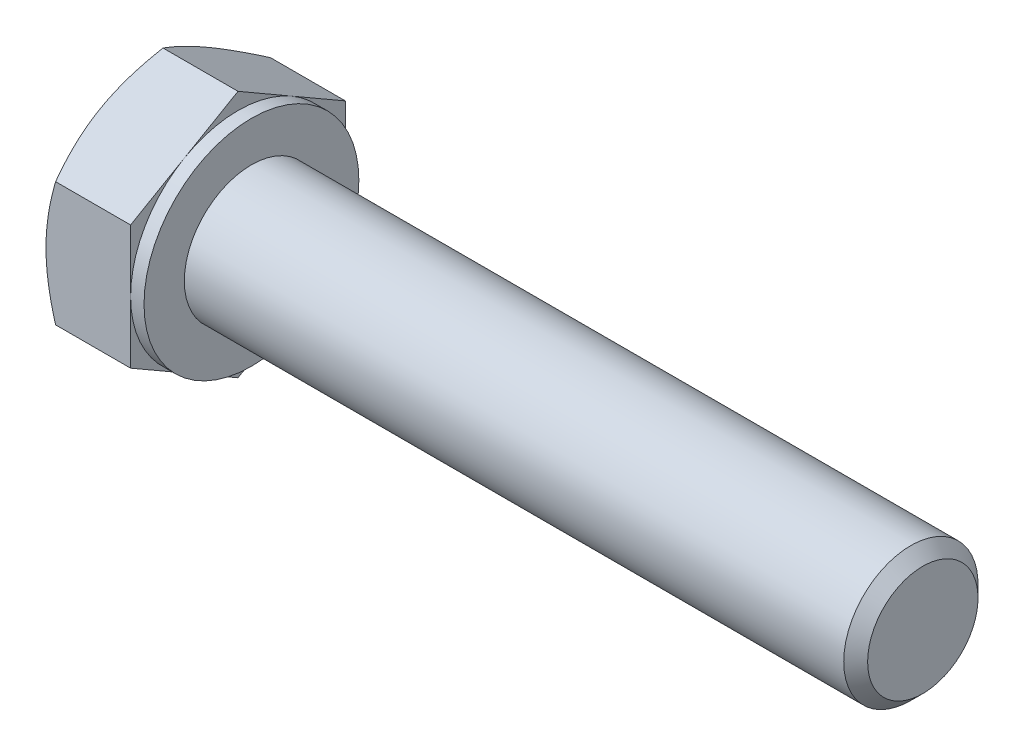
ISO-10303-21;
HEADER;
FILE_DESCRIPTION(('STEP AP214'),'2;1');
FILE_NAME('part.step','',(''),(''),'','','');
FILE_SCHEMA(('AUTOMOTIVE_DESIGN { 1 0 10303 214 1 1 1 1 }'));
ENDSEC;
DATA;
#1=APPLICATION_CONTEXT('core data for automotive mechanical design processes');
#2=APPLICATION_PROTOCOL_DEFINITION('international standard','automotive_design',2000,#1);
#3=PRODUCT_CONTEXT('',#1,'mechanical');
#4=PRODUCT('Part','Part','',(#3));
#5=PRODUCT_RELATED_PRODUCT_CATEGORY('part','',(#4));
#6=PRODUCT_DEFINITION_FORMATION('','',#4);
#7=PRODUCT_DEFINITION_CONTEXT('part definition',#1,'design');
#8=PRODUCT_DEFINITION('design','',#6,#7);
#9=PRODUCT_DEFINITION_SHAPE('','',#8);
#10=(LENGTH_UNIT() NAMED_UNIT(*) SI_UNIT(.MILLI.,.METRE.));
#11=(NAMED_UNIT(*) PLANE_ANGLE_UNIT() SI_UNIT($,.RADIAN.));
#12=(NAMED_UNIT(*) SI_UNIT($,.STERADIAN.) SOLID_ANGLE_UNIT());
#13=UNCERTAINTY_MEASURE_WITH_UNIT(LENGTH_MEASURE(1.E-05),#10,'distance_accuracy_value','');
#14=(GEOMETRIC_REPRESENTATION_CONTEXT(3) GLOBAL_UNCERTAINTY_ASSIGNED_CONTEXT((#13)) GLOBAL_UNIT_ASSIGNED_CONTEXT((#10,
#11,#12)) REPRESENTATION_CONTEXT('',''));
#15=CARTESIAN_POINT('',(0.,0.,0.));
#16=DIRECTION('',(0.,0.,1.));
#17=DIRECTION('',(1.,0.,0.));
#18=AXIS2_PLACEMENT_3D('',#15,#16,#17);
#19=CARTESIAN_POINT('',(3.65,4.61880215351701,0.));
#20=DIRECTION('',(1.,0.,0.));
#21=DIRECTION('',(0.,0.,-1.));
#22=AXIS2_PLACEMENT_3D('',#19,#20,#21);
#23=PLANE('',#22);
#24=CARTESIAN_POINT('',(3.65,0.,0.));
#25=DIRECTION('',(1.,0.,0.));
#26=DIRECTION('',(0.,0.,-1.));
#27=AXIS2_PLACEMENT_3D('',#24,#25,#26);
#28=CIRCLE('',#27,2.5);
#29=CARTESIAN_POINT('',(3.65,0.,-2.5));
#30=VERTEX_POINT('',#29);
#31=EDGE_CURVE('E274',#30,#30,#28,.F.);
#32=ORIENTED_EDGE('',*,*,#31,.T.);
#33=EDGE_LOOP('',(#32));
#34=FACE_BOUND('',#33,.T.);
#35=CARTESIAN_POINT('',(3.65,0.,0.));
#36=DIRECTION('',(1.,0.,0.));
#37=DIRECTION('',(0.,0.,-1.));
#38=AXIS2_PLACEMENT_3D('',#35,#36,#37);
#39=CIRCLE('',#38,4.);
#40=CARTESIAN_POINT('',(3.65,0.,-4.));
#41=VERTEX_POINT('',#40);
#42=EDGE_CURVE('E293',#41,#41,#39,.T.);
#43=ORIENTED_EDGE('',*,*,#42,.T.);
#44=EDGE_LOOP('',(#43));
#45=FACE_BOUND('',#44,.T.);
#46=ADVANCED_FACE('F36',(#34,#45),#23,.T.);
#47=CARTESIAN_POINT('',(0.,0.,0.));
#48=DIRECTION('',(-1.,0.,0.));
#49=DIRECTION('',(0.,0.,1.));
#50=AXIS2_PLACEMENT_3D('',#47,#48,#49);
#51=CYLINDRICAL_SURFACE('',#50,2.5);
#52=ORIENTED_EDGE('',*,*,#31,.F.);
#53=EDGE_LOOP('',(#52));
#54=FACE_BOUND('',#53,.T.);
#55=CARTESIAN_POINT('',(28.205,0.,0.));
#56=DIRECTION('',(-1.,0.,0.));
#57=DIRECTION('',(0.,0.,1.));
#58=AXIS2_PLACEMENT_3D('',#55,#56,#57);
#59=CIRCLE('',#58,2.5);
#60=CARTESIAN_POINT('',(28.205,0.,2.5));
#61=VERTEX_POINT('',#60);
#62=EDGE_CURVE('E271',#61,#61,#59,.T.);
#63=ORIENTED_EDGE('',*,*,#62,.T.);
#64=EDGE_LOOP('',(#63));
#65=FACE_BOUND('',#64,.T.);
#66=ADVANCED_FACE('F245',(#54,#65),#51,.T.);
#67=CARTESIAN_POINT('',(28.65,0.,0.));
#68=DIRECTION('',(-1.,0.,0.));
#69=DIRECTION('',(0.,0.,1.));
#70=AXIS2_PLACEMENT_3D('',#67,#68,#69);
#71=CONICAL_SURFACE('',#70,2.055,0.78539816339744);
#72=ORIENTED_EDGE('',*,*,#62,.F.);
#73=EDGE_LOOP('',(#72));
#74=FACE_BOUND('',#73,.T.);
#75=CARTESIAN_POINT('',(28.65,0.,0.));
#76=DIRECTION('',(-1.,0.,0.));
#77=DIRECTION('',(0.,0.,1.));
#78=AXIS2_PLACEMENT_3D('',#75,#76,#77);
#79=CIRCLE('',#78,2.055);
#80=CARTESIAN_POINT('',(28.65,0.,2.055));
#81=VERTEX_POINT('',#80);
#82=EDGE_CURVE('E269',#81,#81,#79,.T.);
#83=ORIENTED_EDGE('',*,*,#82,.T.);
#84=EDGE_LOOP('',(#83));
#85=FACE_BOUND('',#84,.T.);
#86=ADVANCED_FACE('F250',(#74,#85),#71,.T.);
#87=CARTESIAN_POINT('',(28.65,0.,0.));
#88=DIRECTION('',(-1.,0.,0.));
#89=DIRECTION('',(0.,0.,1.));
#90=AXIS2_PLACEMENT_3D('',#87,#88,#89);
#91=PLANE('',#90);
#92=ORIENTED_EDGE('',*,*,#82,.F.);
#93=EDGE_LOOP('',(#92));
#94=FACE_BOUND('',#93,.T.);
#95=ADVANCED_FACE('F257',(#94),#91,.F.);
#96=CARTESIAN_POINT('',(3.15,4.,0.));
#97=DIRECTION('',(1.,0.,0.));
#98=DIRECTION('',(0.,0.,-1.));
#99=AXIS2_PLACEMENT_3D('',#96,#97,#98);
#100=PLANE('',#99);
#101=DIRECTION('',(0.,0.500000000000001,0.866025403784438));
#102=VECTOR('',#101,1.);
#103=CARTESIAN_POINT('',(3.15,2.3094010767585,-4.));
#104=LINE('',#103,#102);
#105=CARTESIAN_POINT('',(3.15,2.3094010767585,-4.));
#106=VERTEX_POINT('',#105);
#107=CARTESIAN_POINT('',(3.15,3.46410161513775,-2.00000000000001));
#108=VERTEX_POINT('',#107);
#109=EDGE_CURVE('E169',#106,#108,#104,.T.);
#110=ORIENTED_EDGE('',*,*,#109,.T.);
#111=CARTESIAN_POINT('',(3.15,0.,0.));
#112=DIRECTION('',(-1.,0.,0.));
#113=DIRECTION('',(0.,0.,1.));
#114=AXIS2_PLACEMENT_3D('',#111,#112,#113);
#115=CIRCLE('',#114,4.);
#116=CARTESIAN_POINT('',(3.15,0.,-4.));
#117=VERTEX_POINT('',#116);
#118=EDGE_CURVE('E52',#108,#117,#115,.T.);
#119=ORIENTED_EDGE('',*,*,#118,.T.);
#120=DIRECTION('',(0.,1.,0.));
#121=VECTOR('',#120,1.);
#122=CARTESIAN_POINT('',(3.15,2.3094010767585,-4.));
#123=LINE('',#122,#121);
#124=EDGE_CURVE('E41',#117,#106,#123,.T.);
#125=ORIENTED_EDGE('',*,*,#124,.T.);
#126=EDGE_LOOP('',(#110,#119,#125));
#127=FACE_BOUND('',#126,.T.);
#128=ADVANCED_FACE('F260',(#127),#100,.T.);
#129=CARTESIAN_POINT('',(3.15,4.61880215351701,0.));
#130=VERTEX_POINT('',#129);
#131=EDGE_CURVE('E167',#108,#130,#104,.T.);
#132=ORIENTED_EDGE('',*,*,#131,.T.);
#133=DIRECTION('',(0.,-0.500000000000001,0.866025403784438));
#134=VECTOR('',#133,1.);
#135=CARTESIAN_POINT('',(3.15,4.61880215351701,0.));
#136=LINE('',#135,#134);
#137=CARTESIAN_POINT('',(3.15,3.46410161513775,2.));
#138=VERTEX_POINT('',#137);
#139=EDGE_CURVE('E166',#130,#138,#136,.T.);
#140=ORIENTED_EDGE('',*,*,#139,.T.);
#141=EDGE_CURVE('E155',#138,#108,#115,.T.);
#142=ORIENTED_EDGE('',*,*,#141,.T.);
#143=EDGE_LOOP('',(#132,#140,#142));
#144=FACE_BOUND('',#143,.T.);
#145=ADVANCED_FACE('F265',(#144),#100,.T.);
#146=CARTESIAN_POINT('',(3.15,2.30940107675851,3.99999999999999));
#147=VERTEX_POINT('',#146);
#148=EDGE_CURVE('E134',#138,#147,#136,.T.);
#149=ORIENTED_EDGE('',*,*,#148,.T.);
#150=DIRECTION('',(0.,-1.,0.));
#151=VECTOR('',#150,1.);
#152=CARTESIAN_POINT('',(3.15,2.30940107675851,3.99999999999999));
#153=LINE('',#152,#151);
#154=CARTESIAN_POINT('',(3.15,0.,4.));
#155=VERTEX_POINT('',#154);
#156=EDGE_CURVE('E128',#147,#155,#153,.T.);
#157=ORIENTED_EDGE('',*,*,#156,.T.);
#158=EDGE_CURVE('E132',#155,#138,#115,.T.);
#159=ORIENTED_EDGE('',*,*,#158,.T.);
#160=EDGE_LOOP('',(#149,#157,#159));
#161=FACE_BOUND('',#160,.T.);
#162=ADVANCED_FACE('F130',(#161),#100,.T.);
#163=CARTESIAN_POINT('',(3.15,-2.30940107675849,4.));
#164=VERTEX_POINT('',#163);
#165=EDGE_CURVE('E138',#155,#164,#153,.T.);
#166=ORIENTED_EDGE('',*,*,#165,.T.);
#167=DIRECTION('',(0.,-0.500000000000002,-0.866025403784438));
#168=VECTOR('',#167,1.);
#169=CARTESIAN_POINT('',(3.15,-4.618802153517,0.));
#170=LINE('',#169,#168);
#171=CARTESIAN_POINT('',(3.15,-3.46410161513775,2.00000000000001));
#172=VERTEX_POINT('',#171);
#173=EDGE_CURVE('E145',#164,#172,#170,.T.);
#174=ORIENTED_EDGE('',*,*,#173,.T.);
#175=EDGE_CURVE('E142',#172,#155,#115,.T.);
#176=ORIENTED_EDGE('',*,*,#175,.T.);
#177=EDGE_LOOP('',(#166,#174,#176));
#178=FACE_BOUND('',#177,.T.);
#179=ADVANCED_FACE('F143',(#178),#100,.T.);
#180=CARTESIAN_POINT('',(3.15,-4.618802153517,0.));
#181=VERTEX_POINT('',#180);
#182=EDGE_CURVE('E161',#172,#181,#170,.T.);
#183=ORIENTED_EDGE('',*,*,#182,.T.);
#184=DIRECTION('',(0.,0.499999999999999,-0.866025403784439));
#185=VECTOR('',#184,1.);
#186=CARTESIAN_POINT('',(3.15,-2.3094010767585,-4.));
#187=LINE('',#186,#185);
#188=CARTESIAN_POINT('',(3.15,-3.46410161513776,-2.));
#189=VERTEX_POINT('',#188);
#190=EDGE_CURVE('E329',#181,#189,#187,.T.);
#191=ORIENTED_EDGE('',*,*,#190,.T.);
#192=EDGE_CURVE('E149',#189,#172,#115,.T.);
#193=ORIENTED_EDGE('',*,*,#192,.T.);
#194=EDGE_LOOP('',(#183,#191,#193));
#195=FACE_BOUND('',#194,.T.);
#196=ADVANCED_FACE('F334',(#195),#100,.T.);
#197=CARTESIAN_POINT('',(3.15,-2.3094010767585,-4.));
#198=VERTEX_POINT('',#197);
#199=EDGE_CURVE('E156',#189,#198,#187,.T.);
#200=ORIENTED_EDGE('',*,*,#199,.T.);
#201=EDGE_CURVE('E11',#198,#117,#123,.T.);
#202=ORIENTED_EDGE('',*,*,#201,.T.);
#203=EDGE_CURVE('E347',#117,#189,#115,.T.);
#204=ORIENTED_EDGE('',*,*,#203,.T.);
#205=EDGE_LOOP('',(#200,#202,#204));
#206=FACE_BOUND('',#205,.T.);
#207=ADVANCED_FACE('F266',(#206),#100,.T.);
#208=CARTESIAN_POINT('',(0.,0.,0.));
#209=DIRECTION('',(-1.,0.,0.));
#210=DIRECTION('',(0.,0.,1.));
#211=AXIS2_PLACEMENT_3D('',#208,#209,#210);
#212=CYLINDRICAL_SURFACE('',#211,4.);
#213=ORIENTED_EDGE('',*,*,#118,.F.);
#214=ORIENTED_EDGE('',*,*,#141,.F.);
#215=ORIENTED_EDGE('',*,*,#158,.F.);
#216=ORIENTED_EDGE('',*,*,#175,.F.);
#217=ORIENTED_EDGE('',*,*,#192,.F.);
#218=ORIENTED_EDGE('',*,*,#203,.F.);
#219=EDGE_LOOP('',(#213,#214,#215,#216,#217,#218));
#220=FACE_BOUND('',#219,.T.);
#221=ORIENTED_EDGE('',*,*,#42,.F.);
#222=EDGE_LOOP('',(#221));
#223=FACE_BOUND('',#222,.T.);
#224=ADVANCED_FACE('F152',(#220,#223),#212,.T.);
#225=CARTESIAN_POINT('',(0.,4.61880215351701,0.));
#226=DIRECTION('',(1.,0.,0.));
#227=DIRECTION('',(0.,0.,-1.));
#228=AXIS2_PLACEMENT_3D('',#225,#226,#227);
#229=PLANE('',#228);
#230=CARTESIAN_POINT('',(0.,0.,0.));
#231=DIRECTION('',(1.,0.,0.));
#232=DIRECTION('',(0.,0.,-1.));
#233=AXIS2_PLACEMENT_3D('',#230,#231,#232);
#234=CIRCLE('',#233,4.);
#235=CARTESIAN_POINT('',(0.,0.,-4.));
#236=VERTEX_POINT('',#235);
#237=CARTESIAN_POINT('',(0.,3.46410161513775,-2.00000000000001));
#238=VERTEX_POINT('',#237);
#239=EDGE_CURVE('E292',#236,#238,#234,.T.);
#240=ORIENTED_EDGE('',*,*,#239,.F.);
#241=CARTESIAN_POINT('',(0.,-3.46410161513776,-2.));
#242=VERTEX_POINT('',#241);
#243=EDGE_CURVE('E289',#242,#236,#234,.T.);
#244=ORIENTED_EDGE('',*,*,#243,.F.);
#245=CARTESIAN_POINT('',(0.,-3.46410161513775,2.00000000000001));
#246=VERTEX_POINT('',#245);
#247=EDGE_CURVE('E291',#246,#242,#234,.T.);
#248=ORIENTED_EDGE('',*,*,#247,.F.);
#249=CARTESIAN_POINT('',(0.,0.,4.));
#250=VERTEX_POINT('',#249);
#251=EDGE_CURVE('E301',#250,#246,#234,.T.);
#252=ORIENTED_EDGE('',*,*,#251,.F.);
#253=CARTESIAN_POINT('',(0.,0.,0.));
#254=DIRECTION('',(-1.,0.,0.));
#255=DIRECTION('',(0.,0.,1.));
#256=AXIS2_PLACEMENT_3D('',#253,#254,#255);
#257=CIRCLE('',#256,4.);
#258=CARTESIAN_POINT('',(0.,3.46410161513775,2.));
#259=VERTEX_POINT('',#258);
#260=EDGE_CURVE('E170',#250,#259,#257,.T.);
#261=ORIENTED_EDGE('',*,*,#260,.T.);
#262=EDGE_CURVE('E296',#238,#259,#234,.T.);
#263=ORIENTED_EDGE('',*,*,#262,.F.);
#264=EDGE_LOOP('',(#240,#244,#248,#252,#261,#263));
#265=FACE_BOUND('',#264,.T.);
#266=ADVANCED_FACE('F199',(#265),#229,.F.);
#267=CARTESIAN_POINT('',(0.,0.,0.));
#268=DIRECTION('',(1.,0.,0.));
#269=DIRECTION('',(0.,0.,-1.));
#270=AXIS2_PLACEMENT_3D('',#267,#268,#269);
#271=CONICAL_SURFACE('',#270,4.,1.0471975511966);
#272=CARTESIAN_POINT('',(0.357332259074763,2.30928560670467,4.00019999999999));
#273=CARTESIAN_POINT('',(0.29871787364828,2.41077174646171,3.82442084967676));
#274=CARTESIAN_POINT('',(0.245410321462261,2.513133908835,3.64712438367361));
#275=CARTESIAN_POINT('',(0.152361670746402,2.71963072479812,3.28946140682429));
#276=CARTESIAN_POINT('',(0.112653489029703,2.82376904741905,3.10908854102984));
#277=CARTESIAN_POINT('',(0.0508422152802788,3.03075510011796,2.7505781812972));
#278=CARTESIAN_POINT('',(0.028327731522889,3.13357098372492,2.57249584706485));
#279=CARTESIAN_POINT('',(0.00145062314658275,3.33968651028529,2.21549328283349));
#280=CARTESIAN_POINT('',(-0.00293425857305552,3.44298540411435,2.03657435035589));
#281=CARTESIAN_POINT('',(0.00619007293997221,3.63600352522933,1.70225715780326));
#282=CARTESIAN_POINT('',(0.0174589539879965,3.72575165335065,1.54680884001293));
#283=CARTESIAN_POINT('',(0.0531739907981958,3.90466320392055,1.23692494436494));
#284=CARTESIAN_POINT('',(0.0776323457115357,3.99382600759479,1.08249043825587));
#285=CARTESIAN_POINT('',(0.138776064919292,4.17310641015198,0.77196767222542));
#286=CARTESIAN_POINT('',(0.175720603654866,4.26320131938132,0.615918711936896));
#287=CARTESIAN_POINT('',(0.25957007254803,4.44204742827551,0.30614816459616));
#288=CARTESIAN_POINT('',(0.306455302212743,4.53080091904967,0.152422609226221));
#289=CARTESIAN_POINT('',(0.35733225907477,4.61891762357085,-0.000200000000000127));
#290=B_SPLINE_CURVE_WITH_KNOTS('',3,(#272,#273,#274,#275,#276,#277,#278,#279,#280,#281,#282,
#283,#284,#285,#286,#287,#288,#289),.UNSPECIFIED.,.F.,.F.,(4,2,2,2,2,2,2,2,4),(0.,
0.634047835695966,1.26961969224543,1.88946157213122,2.50854226669297,3.04757825393385,
3.58711366126903,4.13861653143763,4.68903648037742),.UNSPECIFIED.);
#291=CARTESIAN_POINT('',(0.357265589908165,4.61880215351701,0.));
#292=VERTEX_POINT('',#291);
#293=EDGE_CURVE('E217',#259,#292,#290,.T.);
#294=ORIENTED_EDGE('',*,*,#293,.T.);
#295=CARTESIAN_POINT('',(0.357332259074769,4.61891762357085,0.0002));
#296=CARTESIAN_POINT('',(0.298717873648285,4.51743148381381,-0.175579150323228));
#297=CARTESIAN_POINT('',(0.245410321462265,4.41506932144052,-0.352875616326381));
#298=CARTESIAN_POINT('',(0.152361670746406,4.2085725054774,-0.710538593175706));
#299=CARTESIAN_POINT('',(0.112653489029706,4.10443418285647,-0.890911458970151));
#300=CARTESIAN_POINT('',(0.0508422152802806,3.89744813015756,-1.24942181870279));
#301=CARTESIAN_POINT('',(0.02832773152289,3.7946322465506,-1.42750415293514));
#302=CARTESIAN_POINT('',(0.00145062314658251,3.58851671999023,-1.78450671716651));
#303=CARTESIAN_POINT('',(-0.00293425857305628,3.48521782616117,-1.9634256496441));
#304=CARTESIAN_POINT('',(0.0061900729399703,3.29219970504619,-2.29774284219673));
#305=CARTESIAN_POINT('',(0.017458953987994,3.20245157692486,-2.45319115998707));
#306=CARTESIAN_POINT('',(0.0531739907981924,3.02354002635497,-2.76307505563506));
#307=CARTESIAN_POINT('',(0.0776323457115321,2.93437722268073,-2.91750956174413));
#308=CARTESIAN_POINT('',(0.138776064919288,2.75509682012354,-3.22803232777458));
#309=CARTESIAN_POINT('',(0.175720603654862,2.6650019108942,-3.3840812880631));
#310=CARTESIAN_POINT('',(0.259570072548025,2.486155802,-3.69385183540384));
#311=CARTESIAN_POINT('',(0.306455302212738,2.39740231122584,-3.84757739077378));
#312=CARTESIAN_POINT('',(0.357332259074764,2.30928560670466,-4.0002));
#313=B_SPLINE_CURVE_WITH_KNOTS('',3,(#295,#296,#297,#298,#299,#300,#301,#302,#303,#304,#305,
#306,#307,#308,#309,#310,#311,#312),.UNSPECIFIED.,.F.,.F.,(4,2,2,2,2,2,2,2,4),(0.,
0.634047835695967,1.26961969224543,1.88946157213122,2.50854226669297,3.04757825393386,
3.58711366126904,4.13861653143764,4.68903648037744),.UNSPECIFIED.);
#314=EDGE_CURVE('E60',#292,#238,#313,.T.);
#315=ORIENTED_EDGE('',*,*,#314,.T.);
#316=ORIENTED_EDGE('',*,*,#262,.T.);
#317=EDGE_LOOP('',(#294,#315,#316));
#318=FACE_BOUND('',#317,.T.);
#319=ADVANCED_FACE('F343',(#318),#271,.T.);
#320=CARTESIAN_POINT('',(2.00011120385046,-6.3020384234118,4.));
#321=CARTESIAN_POINT('',(1.91454696302706,-6.12645846502783,4.));
#322=CARTESIAN_POINT('',(1.82977515690346,-5.95048585438814,4.));
#323=CARTESIAN_POINT('',(1.66226027661303,-5.59754684141579,4.));
#324=CARTESIAN_POINT('',(1.57951750403357,-5.42058029609573,4.));
#325=CARTESIAN_POINT('',(1.4161092617051,-5.06457985037646,4.));
#326=CARTESIAN_POINT('',(1.33545672605323,-4.88553999327038,4.));
#327=CARTESIAN_POINT('',(1.17732357965482,-4.52607013031636,4.));
#328=CARTESIAN_POINT('',(1.09984282527701,-4.34564018785782,4.));
#329=CARTESIAN_POINT('',(0.946328317401932,-3.97695712218341,4.));
#330=CARTESIAN_POINT('',(0.870432703669638,-3.78864617451162,4.));
#331=CARTESIAN_POINT('',(0.724150215280466,-3.40985798807119,4.));
#332=CARTESIAN_POINT('',(0.653763944661544,-3.21938051438195,4.));
#333=CARTESIAN_POINT('',(0.520275623047364,-2.83628176991272,4.));
#334=CARTESIAN_POINT('',(0.45715965099107,-2.64366539743604,4.));
#335=CARTESIAN_POINT('',(0.340171517307153,-2.25567134243401,4.));
#336=CARTESIAN_POINT('',(0.286296547451801,-2.0602945183805,4.));
#337=CARTESIAN_POINT('',(0.190596079734453,-1.66775019550377,4.));
#338=CARTESIAN_POINT('',(0.148703055513719,-1.47059946088018,4.));
#339=CARTESIAN_POINT('',(0.0792701946386885,-1.07374632394225,4.));
#340=CARTESIAN_POINT('',(0.0517287926791943,-0.874044202338188,4.));
#341=CARTESIAN_POINT('',(0.0135517370726251,-0.475733693101269,4.));
#342=CARTESIAN_POINT('',(0.00269106574828716,-0.277147419592168,4.));
#343=CARTESIAN_POINT('',(-0.00180277188208452,0.120241435280113,4.));
#344=CARTESIAN_POINT('',(0.0045643092577363,0.319044019709217,4.));
#345=CARTESIAN_POINT('',(0.0293199840216128,0.653649130511211,4.));
#346=CARTESIAN_POINT('',(0.0433487693682711,0.789796203877411,3.99999999999999));
#347=CARTESIAN_POINT('',(0.0786650583146089,1.06115179654903,3.99999999999999));
#348=CARTESIAN_POINT('',(0.0999534649347826,1.19636019695748,3.99999999999999));
#349=CARTESIAN_POINT('',(0.173595112588807,1.60036108675972,3.99999999999999));
#350=CARTESIAN_POINT('',(0.235713609104601,1.86739657992387,3.99999999999999));
#351=CARTESIAN_POINT('',(0.344187906710576,2.26690842076046,3.99999999999999));
#352=CARTESIAN_POINT('',(0.383434483337922,2.40143348236976,3.99999999999999));
#353=CARTESIAN_POINT('',(0.466191101497679,2.66917849144139,3.99999999999999));
#354=CARTESIAN_POINT('',(0.509701176020063,2.8023984287962,3.99999999999999));
#355=CARTESIAN_POINT('',(0.600271093153284,3.06757339019426,3.99999999999999));
#356=CARTESIAN_POINT('',(0.647329942526203,3.19952875660039,3.99999999999999));
#357=CARTESIAN_POINT('',(0.744425095187851,3.46233233841868,3.99999999999999));
#358=CARTESIAN_POINT('',(0.794461329420509,3.59318057942866,3.99999999999999));
#359=CARTESIAN_POINT('',(0.933355738336686,3.94627302000952,3.99999999999999));
#360=CARTESIAN_POINT('',(1.02459875944488,4.16757823468635,3.99999999999999));
#361=CARTESIAN_POINT('',(1.21247228327858,4.60789849544448,3.99999999999999));
#362=CARTESIAN_POINT('',(1.30910339202328,4.82691328060903,3.99999999999999));
#363=CARTESIAN_POINT('',(1.50647026541792,5.26317250155478,3.99999999999999));
#364=CARTESIAN_POINT('',(1.60720746834517,5.48041628445573,3.99999999999999));
#365=CARTESIAN_POINT('',(1.81181128465854,5.9134283158317,3.99999999999999));
#366=CARTESIAN_POINT('',(1.91567799508362,6.12919651829726,3.99999999999999));
#367=CARTESIAN_POINT('',(2.1260176887459,6.55988021726239,3.99999999999999));
#368=CARTESIAN_POINT('',(2.23249454398487,6.77479381881754,3.99999999999999));
#369=CARTESIAN_POINT('',(2.44739203587053,7.20364802853134,3.99999999999999));
#370=CARTESIAN_POINT('',(2.55581269331614,7.41758862624798,3.99999999999999));
#371=CARTESIAN_POINT('',(2.88334503455634,8.05812603320373,3.99999999999999));
#372=CARTESIAN_POINT('',(3.10477549323411,8.48353660300323,3.99999999999999));
#373=CARTESIAN_POINT('',(3.52798949335262,9.28704830216621,3.99999999999998));
#374=CARTESIAN_POINT('',(3.72935795048665,9.66536912757712,3.99999999999998));
#375=CARTESIAN_POINT('',(4.13451859162103,10.4207405569166,3.99999999999998));
#376=CARTESIAN_POINT('',(4.33831092670878,10.7977910797637,3.99999999999998));
#377=CARTESIAN_POINT('',(4.74699525515911,11.5496417866802,3.99999999999998));
#378=CARTESIAN_POINT('',(4.95188119224406,11.9244452679585,3.99999999999998));
#379=CARTESIAN_POINT('',(5.36302659523093,12.673259459655,3.99999999999998));
#380=CARTESIAN_POINT('',(5.56928595009505,13.0472702310149,3.99999999999998));
#381=CARTESIAN_POINT('',(5.77604503303505,13.4210028084018,3.99999999999998));
#382=B_SPLINE_CURVE_WITH_KNOTS('',3,(#320,#321,#322,#323,#324,#325,#326,#327,#328,#329,#330,
#331,#332,#333,#334,#335,#336,#337,#338,#339,#340,#341,#342,#343,#344,#345,#346,#347,#348,#349,
#350,#351,#352,#353,#354,#355,#356,#357,#358,#359,#360,#361,#362,#363,#364,#365,#366,#367,#368,
#369,#370,#371,#372,#373,#374,#375,#376,#377,#378,#379,#380,#381),.UNSPECIFIED.,.F.,.F.,(4,2,2,
2,2,2,2,2,2,2,2,2,2,2,2,2,2,2,2,2,2,2,2,2,2,2,2,2,2,2,4),(0.,0.585964079589228,1.1720147329867,
1.76109183439221,2.35014223039207,2.95916537113301,3.56825519120251,4.17615863495933,
4.7838770157301,5.38809978568041,5.99225664035711,6.58818972380393,7.18413136680919,
7.59453802315342,8.00499574839965,8.82630883348706,9.24666973074843,9.66703388092332,
10.0872808123363,10.5075180005348,11.2255416622243,11.9436462463738,12.6620045660407,
13.3803851833438,14.0999050636407,14.8194326474842,16.2581595478086,17.5438734370163,
18.8296678929703,20.1111105384062,21.3924508103747),.UNSPECIFIED.);
#383=CARTESIAN_POINT('',(0.35726558990816,2.30940107675851,3.99999999999999));
#384=VERTEX_POINT('',#383);
#385=EDGE_CURVE('E229',#250,#384,#382,.T.);
#386=ORIENTED_EDGE('',*,*,#385,.T.);
#387=EDGE_CURVE('E228',#384,#259,#290,.T.);
#388=ORIENTED_EDGE('',*,*,#387,.T.);
#389=ORIENTED_EDGE('',*,*,#260,.F.);
#390=EDGE_LOOP('',(#386,#388,#389));
#391=FACE_BOUND('',#390,.T.);
#392=ADVANCED_FACE('F339',(#391),#271,.T.);
#393=CARTESIAN_POINT('',(0.357265589908156,-2.30940107675849,4.));
#394=VERTEX_POINT('',#393);
#395=EDGE_CURVE('E272',#394,#250,#382,.T.);
#396=ORIENTED_EDGE('',*,*,#395,.T.);
#397=ORIENTED_EDGE('',*,*,#251,.T.);
#398=CARTESIAN_POINT('',(0.357332259074761,-4.61891762357084,-0.000200000000000053));
#399=CARTESIAN_POINT('',(0.298717873648278,-4.5174314838138,0.175579150323227));
#400=CARTESIAN_POINT('',(0.245410321462258,-4.41506932144051,0.352875616326379));
#401=CARTESIAN_POINT('',(0.152361670746399,-4.20857250547739,0.710538593175704));
#402=CARTESIAN_POINT('',(0.112653489029699,-4.10443418285646,0.890911458970148));
#403=CARTESIAN_POINT('',(0.0508422152802733,-3.89744813015755,1.24942181870279));
#404=CARTESIAN_POINT('',(0.0283277315228833,-3.79463224655059,1.42750415293514));
#405=CARTESIAN_POINT('',(0.0014506231465756,-3.58851671999022,1.7845067171665));
#406=CARTESIAN_POINT('',(-0.00293425857306383,-3.48521782616116,1.96342564964409));
#407=CARTESIAN_POINT('',(0.0061900729399625,-3.29219970504618,2.29774284219673));
#408=CARTESIAN_POINT('',(0.0174589539879866,-3.20245157692485,2.45319115998706));
#409=CARTESIAN_POINT('',(0.0531739907981856,-3.02354002635495,2.76307505563505));
#410=CARTESIAN_POINT('',(0.0776323457115254,-2.93437722268071,2.91750956174413));
#411=CARTESIAN_POINT('',(0.138776064919282,-2.75509682012352,3.22803232777458));
#412=CARTESIAN_POINT('',(0.175720603654856,-2.66500191089418,3.3840812880631));
#413=CARTESIAN_POINT('',(0.259570072548019,-2.48615580199999,3.69385183540384));
#414=CARTESIAN_POINT('',(0.306455302212733,-2.39740231122583,3.84757739077378));
#415=CARTESIAN_POINT('',(0.35733225907476,-2.30928560670465,4.0002));
#416=B_SPLINE_CURVE_WITH_KNOTS('',3,(#398,#399,#400,#401,#402,#403,#404,#405,#406,#407,#408,
#409,#410,#411,#412,#413,#414,#415),.UNSPECIFIED.,.F.,.F.,(4,2,2,2,2,2,2,2,4),(0.,
0.634047835695965,1.26961969224543,1.88946157213122,2.50854226669297,3.04757825393385,
3.58711366126903,4.13861653143764,4.68903648037744),.UNSPECIFIED.);
#417=EDGE_CURVE('E219',#246,#394,#416,.T.);
#418=ORIENTED_EDGE('',*,*,#417,.T.);
#419=EDGE_LOOP('',(#396,#397,#418));
#420=FACE_BOUND('',#419,.T.);
#421=ADVANCED_FACE('F188',(#420),#271,.T.);
#422=CARTESIAN_POINT('',(0.357265589908158,-4.618802153517,0.));
#423=VERTEX_POINT('',#422);
#424=EDGE_CURVE('E212',#423,#246,#416,.T.);
#425=ORIENTED_EDGE('',*,*,#424,.T.);
#426=ORIENTED_EDGE('',*,*,#247,.T.);
#427=CARTESIAN_POINT('',(0.357332259074765,-2.30928560670466,-4.0002));
#428=CARTESIAN_POINT('',(0.298717873648281,-2.4107717464617,-3.82442084967677));
#429=CARTESIAN_POINT('',(0.245410321462261,-2.51313390883499,-3.64712438367362));
#430=CARTESIAN_POINT('',(0.152361670746402,-2.71963072479811,-3.28946140682429));
#431=CARTESIAN_POINT('',(0.112653489029703,-2.82376904741904,-3.10908854102985));
#432=CARTESIAN_POINT('',(0.0508422152802772,-3.03075510011795,-2.75057818129721));
#433=CARTESIAN_POINT('',(0.0283277315228866,-3.13357098372491,-2.57249584706486));
#434=CARTESIAN_POINT('',(0.00145062314657942,-3.33968651028528,-2.21549328283349));
#435=CARTESIAN_POINT('',(-0.00293425857305899,-3.44298540411434,-2.0365743503559));
#436=CARTESIAN_POINT('',(0.00619007293996785,-3.63600352522932,-1.70225715780327));
#437=CARTESIAN_POINT('',(0.0174589539879915,-3.72575165335064,-1.54680884001293));
#438=CARTESIAN_POINT('',(0.0531739907981897,-3.90466320392054,-1.23692494436494));
#439=CARTESIAN_POINT('',(0.0776323457115292,-3.99382600759478,-1.08249043825587));
#440=CARTESIAN_POINT('',(0.138776064919285,-4.17310641015196,-0.771967672225421));
#441=CARTESIAN_POINT('',(0.175720603654859,-4.26320131938131,-0.615918711936897));
#442=CARTESIAN_POINT('',(0.259570072548022,-4.4420474282755,-0.30614816459616));
#443=CARTESIAN_POINT('',(0.306455302212735,-4.53080091904966,-0.152422609226221));
#444=CARTESIAN_POINT('',(0.357332259074762,-4.61891762357084,0.000200000000000376));
#445=B_SPLINE_CURVE_WITH_KNOTS('',3,(#427,#428,#429,#430,#431,#432,#433,#434,#435,#436,#437,
#438,#439,#440,#441,#442,#443,#444),.UNSPECIFIED.,.F.,.F.,(4,2,2,2,2,2,2,2,4),(0.,
0.634047835695966,1.26961969224543,1.88946157213122,2.50854226669297,3.04757825393386,
3.58711366126903,4.13861653143763,4.68903648037743),.UNSPECIFIED.);
#446=EDGE_CURVE('E218',#242,#423,#445,.T.);
#447=ORIENTED_EDGE('',*,*,#446,.T.);
#448=EDGE_LOOP('',(#425,#426,#447));
#449=FACE_BOUND('',#448,.T.);
#450=ADVANCED_FACE('F310',(#449),#271,.T.);
#451=CARTESIAN_POINT('',(0.357265589908161,2.3094010767585,-4.));
#452=VERTEX_POINT('',#451);
#453=EDGE_CURVE('E220',#238,#452,#313,.T.);
#454=ORIENTED_EDGE('',*,*,#453,.T.);
#455=CARTESIAN_POINT('',(2.00011120385047,-6.30203842341183,-4.));
#456=CARTESIAN_POINT('',(1.91454696302707,-6.12645846502785,-4.));
#457=CARTESIAN_POINT('',(1.82977515690347,-5.95048585438816,-4.));
#458=CARTESIAN_POINT('',(1.66226027661304,-5.59754684141581,-4.));
#459=CARTESIAN_POINT('',(1.57951750403358,-5.42058029609575,-4.));
#460=CARTESIAN_POINT('',(1.41610926170511,-5.06457985037648,-4.));
#461=CARTESIAN_POINT('',(1.33545672605324,-4.8855399932704,-4.));
#462=CARTESIAN_POINT('',(1.17732357965483,-4.52607013031638,-4.));
#463=CARTESIAN_POINT('',(1.09984282527701,-4.34564018785784,-4.));
#464=CARTESIAN_POINT('',(0.946328317401939,-3.97695712218343,-4.));
#465=CARTESIAN_POINT('',(0.870432703669645,-3.78864617451164,-4.));
#466=CARTESIAN_POINT('',(0.724150215280472,-3.40985798807121,-4.));
#467=CARTESIAN_POINT('',(0.653763944661551,-3.21938051438197,-4.));
#468=CARTESIAN_POINT('',(0.52027562304737,-2.83628176991273,-4.));
#469=CARTESIAN_POINT('',(0.457159650991075,-2.64366539743605,-4.));
#470=CARTESIAN_POINT('',(0.340171517307158,-2.25567134243403,-4.));
#471=CARTESIAN_POINT('',(0.286296547451806,-2.06029451838051,-4.));
#472=CARTESIAN_POINT('',(0.190596079734458,-1.66775019550379,-4.));
#473=CARTESIAN_POINT('',(0.148703055513723,-1.4705994608802,-4.));
#474=CARTESIAN_POINT('',(0.0792701946386919,-1.07374632394227,-4.));
#475=CARTESIAN_POINT('',(0.0517287926791973,-0.874044202338202,-4.));
#476=CARTESIAN_POINT('',(0.0135517370726276,-0.475733693101282,-4.));
#477=CARTESIAN_POINT('',(0.00269106574828951,-0.277147419592181,-4.));
#478=CARTESIAN_POINT('',(-0.00180277188208248,0.1202414352801,-4.));
#479=CARTESIAN_POINT('',(0.00456430925773821,0.319044019709204,-4.));
#480=CARTESIAN_POINT('',(0.0293199840216142,0.653649130511199,-4.));
#481=CARTESIAN_POINT('',(0.0433487693682722,0.789796203877399,-4.));
#482=CARTESIAN_POINT('',(0.0786650583146097,1.06115179654902,-4.));
#483=CARTESIAN_POINT('',(0.0999534649347834,1.19636019695747,-4.));
#484=CARTESIAN_POINT('',(0.173595112588808,1.6003610867597,-4.));
#485=CARTESIAN_POINT('',(0.235713609104602,1.86739657992386,-4.));
#486=CARTESIAN_POINT('',(0.344187906710575,2.26690842076045,-4.));
#487=CARTESIAN_POINT('',(0.383434483337921,2.40143348236975,-4.));
#488=CARTESIAN_POINT('',(0.466191101497677,2.66917849144138,-4.));
#489=CARTESIAN_POINT('',(0.509701176020062,2.80239842879618,-4.));
#490=CARTESIAN_POINT('',(0.600271093153283,3.06757339019425,-4.));
#491=CARTESIAN_POINT('',(0.647329942526201,3.19952875660038,-4.));
#492=CARTESIAN_POINT('',(0.744425095187849,3.46233233841867,-4.));
#493=CARTESIAN_POINT('',(0.794461329420507,3.59318057942865,-4.));
#494=CARTESIAN_POINT('',(0.933355738336684,3.94627302000951,-4.));
#495=CARTESIAN_POINT('',(1.02459875944488,4.16757823468634,-4.));
#496=CARTESIAN_POINT('',(1.21247228327858,4.60789849544447,-4.));
#497=CARTESIAN_POINT('',(1.30910339202328,4.82691328060902,-4.));
#498=CARTESIAN_POINT('',(1.50647026541792,5.26317250155477,-4.));
#499=CARTESIAN_POINT('',(1.60720746834517,5.48041628445572,-4.));
#500=CARTESIAN_POINT('',(1.81181128465854,5.9134283158317,-4.));
#501=CARTESIAN_POINT('',(1.91567799508362,6.12919651829725,-4.));
#502=CARTESIAN_POINT('',(2.1260176887459,6.55988021726238,-4.));
#503=CARTESIAN_POINT('',(2.23249454398487,6.77479381881754,-4.));
#504=CARTESIAN_POINT('',(2.44739203587054,7.20364802853133,-4.));
#505=CARTESIAN_POINT('',(2.55581269331615,7.41758862624798,-4.));
#506=CARTESIAN_POINT('',(2.88334503455634,8.05812603320373,-4.));
#507=CARTESIAN_POINT('',(3.10477549323412,8.48353660300323,-4.));
#508=CARTESIAN_POINT('',(3.52798949335263,9.28704830216621,-4.));
#509=CARTESIAN_POINT('',(3.72935795048666,9.66536912757713,-4.));
#510=CARTESIAN_POINT('',(4.13451859162104,10.4207405569166,-4.));
#511=CARTESIAN_POINT('',(4.33831092670879,10.7977910797637,-4.));
#512=CARTESIAN_POINT('',(4.74699525515912,11.5496417866802,-4.));
#513=CARTESIAN_POINT('',(4.95188119224407,11.9244452679585,-4.));
#514=CARTESIAN_POINT('',(5.36302659523094,12.673259459655,-4.));
#515=CARTESIAN_POINT('',(5.56928595009505,13.0472702310149,-4.));
#516=CARTESIAN_POINT('',(5.77604503303505,13.4210028084018,-4.));
#517=B_SPLINE_CURVE_WITH_KNOTS('',3,(#455,#456,#457,#458,#459,#460,#461,#462,#463,#464,#465,
#466,#467,#468,#469,#470,#471,#472,#473,#474,#475,#476,#477,#478,#479,#480,#481,#482,#483,#484,
#485,#486,#487,#488,#489,#490,#491,#492,#493,#494,#495,#496,#497,#498,#499,#500,#501,#502,#503,
#504,#505,#506,#507,#508,#509,#510,#511,#512,#513,#514,#515,#516),.UNSPECIFIED.,.F.,.F.,(4,2,2,
2,2,2,2,2,2,2,2,2,2,2,2,2,2,2,2,2,2,2,2,2,2,2,2,2,2,2,4),(0.,0.585964079589229,1.1720147329867,
1.76109183439221,2.35014223039207,2.95916537113302,3.56825519120251,4.17615863495934,
4.78387701573011,5.38809978568042,5.99225664035712,6.58818972380394,7.1841313668092,
7.59453802315343,8.00499574839967,8.82630883348707,9.24666973074843,9.66703388092333,
10.0872808123363,10.5075180005348,11.2255416622244,11.9436462463738,12.6620045660407,
13.3803851833438,14.0999050636407,14.8194326474842,16.2581595478086,17.5438734370163,
18.8296678929704,20.1111105384062,21.3924508103747),.UNSPECIFIED.);
#518=EDGE_CURVE('E181',#452,#236,#517,.F.);
#519=ORIENTED_EDGE('',*,*,#518,.T.);
#520=ORIENTED_EDGE('',*,*,#239,.T.);
#521=EDGE_LOOP('',(#454,#519,#520));
#522=FACE_BOUND('',#521,.T.);
#523=ADVANCED_FACE('F324',(#522),#271,.T.);
#524=CARTESIAN_POINT('',(0.357265589908043,-2.30940107675868,-4.));
#525=VERTEX_POINT('',#524);
#526=EDGE_CURVE('E182',#525,#242,#445,.T.);
#527=ORIENTED_EDGE('',*,*,#526,.T.);
#528=ORIENTED_EDGE('',*,*,#243,.T.);
#529=EDGE_CURVE('E173',#236,#525,#517,.F.);
#530=ORIENTED_EDGE('',*,*,#529,.T.);
#531=EDGE_LOOP('',(#527,#528,#530));
#532=FACE_BOUND('',#531,.T.);
#533=ADVANCED_FACE('F197',(#532),#271,.T.);
#534=CARTESIAN_POINT('',(3.65,2.3094010767585,-4.));
#535=DIRECTION('',(0.,0.,1.));
#536=DIRECTION('',(1.,0.,0.));
#537=AXIS2_PLACEMENT_3D('',#534,#535,#536);
#538=PLANE('',#537);
#539=ORIENTED_EDGE('',*,*,#201,.F.);
#540=DIRECTION('',(-1.,0.,0.));
#541=VECTOR('',#540,1.);
#542=CARTESIAN_POINT('',(3.65,-2.3094010767585,-4.));
#543=LINE('',#542,#541);
#544=EDGE_CURVE('E280',#198,#525,#543,.T.);
#545=ORIENTED_EDGE('',*,*,#544,.T.);
#546=ORIENTED_EDGE('',*,*,#529,.F.);
#547=ORIENTED_EDGE('',*,*,#518,.F.);
#548=DIRECTION('',(-1.,0.,0.));
#549=VECTOR('',#548,1.);
#550=CARTESIAN_POINT('',(3.65,2.3094010767585,-4.));
#551=LINE('',#550,#549);
#552=EDGE_CURVE('E278',#106,#452,#551,.T.);
#553=ORIENTED_EDGE('',*,*,#552,.F.);
#554=ORIENTED_EDGE('',*,*,#124,.F.);
#555=EDGE_LOOP('',(#539,#545,#546,#547,#553,#554));
#556=FACE_BOUND('',#555,.T.);
#557=ADVANCED_FACE('F192',(#556),#538,.F.);
#558=CARTESIAN_POINT('',(3.65,-2.3094010767585,-4.));
#559=DIRECTION('',(0.,0.866025403784439,0.499999999999999));
#560=DIRECTION('',(0.,-0.499999999999999,0.866025403784439));
#561=AXIS2_PLACEMENT_3D('',#558,#559,#560);
#562=PLANE('',#561);
#563=ORIENTED_EDGE('',*,*,#190,.F.);
#564=DIRECTION('',(-1.,0.,0.));
#565=VECTOR('',#564,1.);
#566=CARTESIAN_POINT('',(3.65,-4.618802153517,0.));
#567=LINE('',#566,#565);
#568=EDGE_CURVE('E282',#181,#423,#567,.T.);
#569=ORIENTED_EDGE('',*,*,#568,.T.);
#570=ORIENTED_EDGE('',*,*,#446,.F.);
#571=ORIENTED_EDGE('',*,*,#526,.F.);
#572=ORIENTED_EDGE('',*,*,#544,.F.);
#573=ORIENTED_EDGE('',*,*,#199,.F.);
#574=EDGE_LOOP('',(#563,#569,#570,#571,#572,#573));
#575=FACE_BOUND('',#574,.T.);
#576=ADVANCED_FACE('F196',(#575),#562,.F.);
#577=CARTESIAN_POINT('',(3.65,-4.618802153517,0.));
#578=DIRECTION('',(0.,0.866025403784437,-0.500000000000002));
#579=DIRECTION('',(0.,0.500000000000002,0.866025403784438));
#580=AXIS2_PLACEMENT_3D('',#577,#578,#579);
#581=PLANE('',#580);
#582=ORIENTED_EDGE('',*,*,#173,.F.);
#583=DIRECTION('',(-1.,0.,0.));
#584=VECTOR('',#583,1.);
#585=CARTESIAN_POINT('',(3.65,-2.30940107675849,4.));
#586=LINE('',#585,#584);
#587=EDGE_CURVE('E160',#164,#394,#586,.T.);
#588=ORIENTED_EDGE('',*,*,#587,.T.);
#589=ORIENTED_EDGE('',*,*,#417,.F.);
#590=ORIENTED_EDGE('',*,*,#424,.F.);
#591=ORIENTED_EDGE('',*,*,#568,.F.);
#592=ORIENTED_EDGE('',*,*,#182,.F.);
#593=EDGE_LOOP('',(#582,#588,#589,#590,#591,#592));
#594=FACE_BOUND('',#593,.T.);
#595=ADVANCED_FACE('F204',(#594),#581,.F.);
#596=CARTESIAN_POINT('',(3.65,2.30940107675851,3.99999999999999));
#597=DIRECTION('',(0.,0.,-1.));
#598=DIRECTION('',(0.,1.,0.));
#599=AXIS2_PLACEMENT_3D('',#596,#597,#598);
#600=PLANE('',#599);
#601=ORIENTED_EDGE('',*,*,#156,.F.);
#602=DIRECTION('',(-1.,0.,0.));
#603=VECTOR('',#602,1.);
#604=CARTESIAN_POINT('',(3.65,2.30940107675851,3.99999999999999));
#605=LINE('',#604,#603);
#606=EDGE_CURVE('E285',#147,#384,#605,.T.);
#607=ORIENTED_EDGE('',*,*,#606,.T.);
#608=ORIENTED_EDGE('',*,*,#385,.F.);
#609=ORIENTED_EDGE('',*,*,#395,.F.);
#610=ORIENTED_EDGE('',*,*,#587,.F.);
#611=ORIENTED_EDGE('',*,*,#165,.F.);
#612=EDGE_LOOP('',(#601,#607,#608,#609,#610,#611));
#613=FACE_BOUND('',#612,.T.);
#614=ADVANCED_FACE('F158',(#613),#600,.F.);
#615=CARTESIAN_POINT('',(3.65,4.61880215351701,0.));
#616=DIRECTION('',(0.,-0.866025403784438,-0.500000000000001));
#617=DIRECTION('',(0.,0.500000000000001,-0.866025403784438));
#618=AXIS2_PLACEMENT_3D('',#615,#616,#617);
#619=PLANE('',#618);
#620=ORIENTED_EDGE('',*,*,#139,.F.);
#621=DIRECTION('',(-1.,0.,0.));
#622=VECTOR('',#621,1.);
#623=CARTESIAN_POINT('',(3.65,4.61880215351701,0.));
#624=LINE('',#623,#622);
#625=EDGE_CURVE('E287',#130,#292,#624,.T.);
#626=ORIENTED_EDGE('',*,*,#625,.T.);
#627=ORIENTED_EDGE('',*,*,#293,.F.);
#628=ORIENTED_EDGE('',*,*,#387,.F.);
#629=ORIENTED_EDGE('',*,*,#606,.F.);
#630=ORIENTED_EDGE('',*,*,#148,.F.);
#631=EDGE_LOOP('',(#620,#626,#627,#628,#629,#630));
#632=FACE_BOUND('',#631,.T.);
#633=ADVANCED_FACE('F234',(#632),#619,.F.);
#634=CARTESIAN_POINT('',(3.65,2.3094010767585,-4.));
#635=DIRECTION('',(0.,-0.866025403784438,0.500000000000002));
#636=DIRECTION('',(0.,-0.500000000000001,-0.866025403784438));
#637=AXIS2_PLACEMENT_3D('',#634,#635,#636);
#638=PLANE('',#637);
#639=ORIENTED_EDGE('',*,*,#109,.F.);
#640=ORIENTED_EDGE('',*,*,#552,.T.);
#641=ORIENTED_EDGE('',*,*,#453,.F.);
#642=ORIENTED_EDGE('',*,*,#314,.F.);
#643=ORIENTED_EDGE('',*,*,#625,.F.);
#644=ORIENTED_EDGE('',*,*,#131,.F.);
#645=EDGE_LOOP('',(#639,#640,#641,#642,#643,#644));
#646=FACE_BOUND('',#645,.T.);
#647=ADVANCED_FACE('F38',(#646),#638,.F.);
#648=CLOSED_SHELL('',(#46,#66,#86,#95,#128,#145,#162,#179,#196,#207,#224,#266,#319,#392,#421,
#450,#523,#533,#557,#576,#595,#614,#633,#647));
#649=MANIFOLD_SOLID_BREP('B2',#648);
#650=ADVANCED_BREP_SHAPE_REPRESENTATION('',(#18,#649),#14);
#651=SHAPE_DEFINITION_REPRESENTATION(#9,#650);
ENDSEC;
END-ISO-10303-21;
